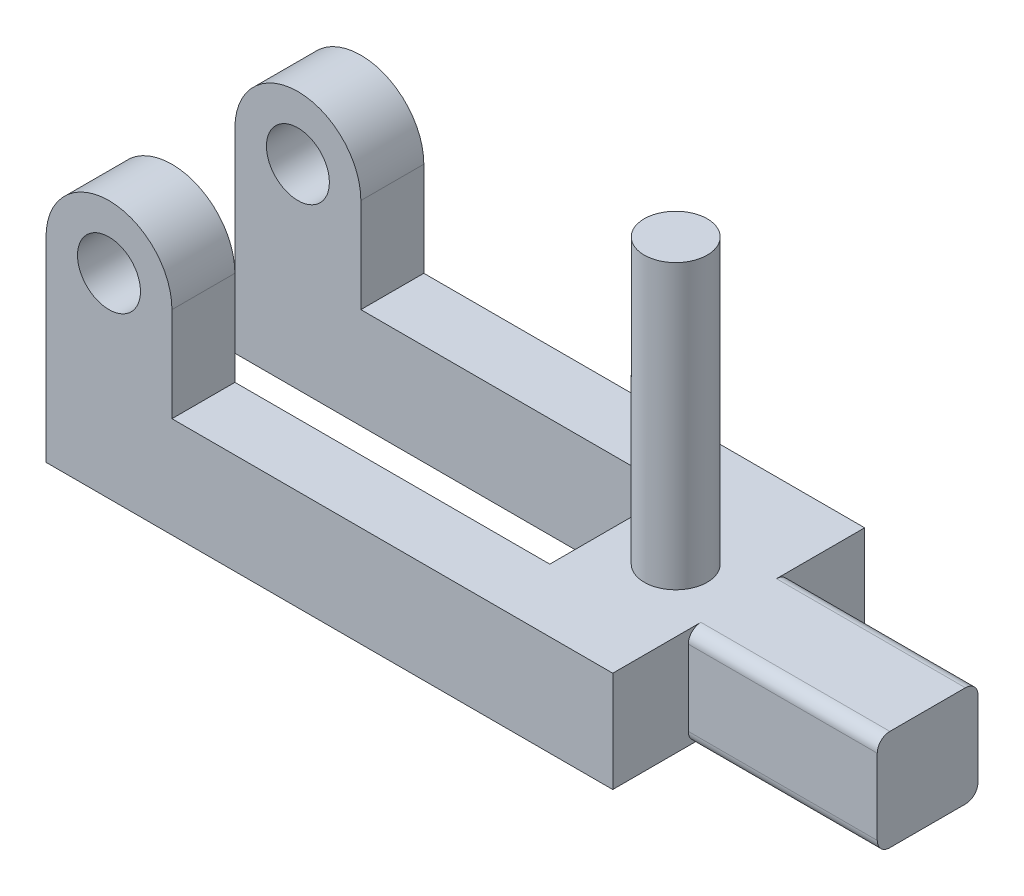
ISO-10303-21;
HEADER;
FILE_DESCRIPTION(('STEP AP214'),'2;1');
FILE_NAME('part.step','',(''),(''),'','','');
FILE_SCHEMA(('AUTOMOTIVE_DESIGN { 1 0 10303 214 1 1 1 1 }'));
ENDSEC;
DATA;
#1=APPLICATION_CONTEXT('core data for automotive mechanical design processes');
#2=APPLICATION_PROTOCOL_DEFINITION('international standard','automotive_design',2000,#1);
#3=PRODUCT_CONTEXT('',#1,'mechanical');
#4=PRODUCT('Part','Part','',(#3));
#5=PRODUCT_RELATED_PRODUCT_CATEGORY('part','',(#4));
#6=PRODUCT_DEFINITION_FORMATION('','',#4);
#7=PRODUCT_DEFINITION_CONTEXT('part definition',#1,'design');
#8=PRODUCT_DEFINITION('design','',#6,#7);
#9=PRODUCT_DEFINITION_SHAPE('','',#8);
#10=(LENGTH_UNIT() NAMED_UNIT(*) SI_UNIT(.MILLI.,.METRE.));
#11=(NAMED_UNIT(*) PLANE_ANGLE_UNIT() SI_UNIT($,.RADIAN.));
#12=(NAMED_UNIT(*) SI_UNIT($,.STERADIAN.) SOLID_ANGLE_UNIT());
#13=UNCERTAINTY_MEASURE_WITH_UNIT(LENGTH_MEASURE(1.E-05),#10,'distance_accuracy_value','');
#14=(GEOMETRIC_REPRESENTATION_CONTEXT(3) GLOBAL_UNCERTAINTY_ASSIGNED_CONTEXT((#13)) GLOBAL_UNIT_ASSIGNED_CONTEXT((#10,
#11,#12)) REPRESENTATION_CONTEXT('',''));
#15=CARTESIAN_POINT('',(0.,0.,0.));
#16=DIRECTION('',(0.,0.,1.));
#17=DIRECTION('',(1.,0.,0.));
#18=AXIS2_PLACEMENT_3D('',#15,#16,#17);
#19=CARTESIAN_POINT('',(0.,16.,0.));
#20=DIRECTION('',(1.,0.,0.));
#21=DIRECTION('',(0.,0.,-1.));
#22=AXIS2_PLACEMENT_3D('',#19,#20,#21);
#23=PLANE('',#22);
#24=DIRECTION('',(0.,0.,1.));
#25=VECTOR('',#24,1.);
#26=CARTESIAN_POINT('',(0.,0.,0.));
#27=LINE('',#26,#25);
#28=CARTESIAN_POINT('',(0.,0.,-10.));
#29=VERTEX_POINT('',#28);
#30=CARTESIAN_POINT('',(0.,0.,0.));
#31=VERTEX_POINT('',#30);
#32=EDGE_CURVE('E226',#29,#31,#27,.T.);
#33=ORIENTED_EDGE('',*,*,#32,.T.);
#34=DIRECTION('',(0.,-1.,0.));
#35=VECTOR('',#34,1.);
#36=CARTESIAN_POINT('',(0.,16.,0.));
#37=LINE('',#36,#35);
#38=CARTESIAN_POINT('',(0.,31.,0.));
#39=VERTEX_POINT('',#38);
#40=EDGE_CURVE('E297',#39,#31,#37,.T.);
#41=ORIENTED_EDGE('',*,*,#40,.F.);
#42=DIRECTION('',(0.,0.,1.));
#43=VECTOR('',#42,1.);
#44=CARTESIAN_POINT('',(0.,31.,-10.));
#45=LINE('',#44,#43);
#46=CARTESIAN_POINT('',(0.,31.,-10.));
#47=VERTEX_POINT('',#46);
#48=EDGE_CURVE('E223',#47,#39,#45,.T.);
#49=ORIENTED_EDGE('',*,*,#48,.F.);
#50=DIRECTION('',(0.,-1.,0.));
#51=VECTOR('',#50,1.);
#52=CARTESIAN_POINT('',(0.,16.,-10.));
#53=LINE('',#52,#51);
#54=EDGE_CURVE('E246',#47,#29,#53,.T.);
#55=ORIENTED_EDGE('',*,*,#54,.T.);
#56=EDGE_LOOP('',(#33,#41,#49,#55));
#57=FACE_BOUND('',#56,.T.);
#58=ADVANCED_FACE('F33',(#57),#23,.F.);
#59=CARTESIAN_POINT('',(0.,16.,0.));
#60=DIRECTION('',(0.,0.,-1.));
#61=DIRECTION('',(-1.,0.,0.));
#62=AXIS2_PLACEMENT_3D('',#59,#60,#61);
#63=PLANE('',#62);
#64=DIRECTION('',(1.,0.,0.));
#65=VECTOR('',#64,1.);
#66=CARTESIAN_POINT('',(0.,0.,0.));
#67=LINE('',#66,#65);
#68=CARTESIAN_POINT('',(90.,0.,0.));
#69=VERTEX_POINT('',#68);
#70=EDGE_CURVE('E249',#31,#69,#67,.T.);
#71=ORIENTED_EDGE('',*,*,#70,.T.);
#72=DIRECTION('',(0.,-1.,0.));
#73=VECTOR('',#72,1.);
#74=CARTESIAN_POINT('',(90.,16.,0.));
#75=LINE('',#74,#73);
#76=CARTESIAN_POINT('',(90.,16.,0.));
#77=VERTEX_POINT('',#76);
#78=EDGE_CURVE('E294',#77,#69,#75,.T.);
#79=ORIENTED_EDGE('',*,*,#78,.F.);
#80=DIRECTION('',(1.,0.,0.));
#81=VECTOR('',#80,1.);
#82=CARTESIAN_POINT('',(0.,16.,0.));
#83=LINE('',#82,#81);
#84=CARTESIAN_POINT('',(20.,16.,0.));
#85=VERTEX_POINT('',#84);
#86=EDGE_CURVE('E230',#85,#77,#83,.T.);
#87=ORIENTED_EDGE('',*,*,#86,.F.);
#88=DIRECTION('',(0.,1.,0.));
#89=VECTOR('',#88,1.);
#90=CARTESIAN_POINT('',(20.,16.,0.));
#91=LINE('',#90,#89);
#92=CARTESIAN_POINT('',(20.,31.,0.));
#93=VERTEX_POINT('',#92);
#94=EDGE_CURVE('E208',#85,#93,#91,.T.);
#95=ORIENTED_EDGE('',*,*,#94,.T.);
#96=CARTESIAN_POINT('',(9.99999999999999,31.,0.));
#97=DIRECTION('',(0.,0.,1.));
#98=DIRECTION('',(1.,0.,0.));
#99=AXIS2_PLACEMENT_3D('',#96,#97,#98);
#100=CIRCLE('',#99,9.99999999999999);
#101=EDGE_CURVE('E215',#93,#39,#100,.T.);
#102=ORIENTED_EDGE('',*,*,#101,.T.);
#103=ORIENTED_EDGE('',*,*,#40,.T.);
#104=EDGE_LOOP('',(#71,#79,#87,#95,#102,#103));
#105=FACE_BOUND('',#104,.T.);
#106=CARTESIAN_POINT('',(9.99999999999999,31.,0.));
#107=DIRECTION('',(0.,0.,1.));
#108=DIRECTION('',(1.,0.,0.));
#109=AXIS2_PLACEMENT_3D('',#106,#107,#108);
#110=CIRCLE('',#109,5.);
#111=CARTESIAN_POINT('',(15.,31.,0.));
#112=VERTEX_POINT('',#111);
#113=EDGE_CURVE('E203',#112,#112,#110,.T.);
#114=ORIENTED_EDGE('',*,*,#113,.F.);
#115=EDGE_LOOP('',(#114));
#116=FACE_BOUND('',#115,.T.);
#117=ADVANCED_FACE('F386',(#105,#116),#63,.F.);
#118=CARTESIAN_POINT('',(90.,16.,0.));
#119=DIRECTION('',(-1.,0.,0.));
#120=DIRECTION('',(0.,0.,1.));
#121=AXIS2_PLACEMENT_3D('',#118,#119,#120);
#122=PLANE('',#121);
#123=DIRECTION('',(0.,0.,-1.));
#124=VECTOR('',#123,1.);
#125=CARTESIAN_POINT('',(90.,0.,0.));
#126=LINE('',#125,#124);
#127=CARTESIAN_POINT('',(90.,0.,-14.));
#128=VERTEX_POINT('',#127);
#129=EDGE_CURVE('E251',#69,#128,#126,.T.);
#130=ORIENTED_EDGE('',*,*,#129,.T.);
#131=CARTESIAN_POINT('',(90.,2.,-14.));
#132=DIRECTION('',(-1.,0.,0.));
#133=DIRECTION('',(0.,0.,1.));
#134=AXIS2_PLACEMENT_3D('',#131,#132,#133);
#135=CIRCLE('',#134,2.);
#136=CARTESIAN_POINT('',(90.,2.,-12.));
#137=VERTEX_POINT('',#136);
#138=EDGE_CURVE('E332',#128,#137,#135,.T.);
#139=ORIENTED_EDGE('',*,*,#138,.T.);
#140=DIRECTION('',(0.,-1.,0.));
#141=VECTOR('',#140,1.);
#142=CARTESIAN_POINT('',(90.,16.,-12.));
#143=LINE('',#142,#141);
#144=CARTESIAN_POINT('',(90.,14.,-12.));
#145=VERTEX_POINT('',#144);
#146=EDGE_CURVE('E291',#145,#137,#143,.T.);
#147=ORIENTED_EDGE('',*,*,#146,.F.);
#148=CARTESIAN_POINT('',(90.,14.,-14.));
#149=DIRECTION('',(-1.,0.,0.));
#150=DIRECTION('',(0.,0.,1.));
#151=AXIS2_PLACEMENT_3D('',#148,#149,#150);
#152=CIRCLE('',#151,2.);
#153=CARTESIAN_POINT('',(90.,16.,-14.));
#154=VERTEX_POINT('',#153);
#155=EDGE_CURVE('E41',#145,#154,#152,.T.);
#156=ORIENTED_EDGE('',*,*,#155,.T.);
#157=DIRECTION('',(0.,0.,-1.));
#158=VECTOR('',#157,1.);
#159=CARTESIAN_POINT('',(90.,16.,0.));
#160=LINE('',#159,#158);
#161=EDGE_CURVE('E232',#77,#154,#160,.T.);
#162=ORIENTED_EDGE('',*,*,#161,.F.);
#163=ORIENTED_EDGE('',*,*,#78,.T.);
#164=EDGE_LOOP('',(#130,#139,#147,#156,#162,#163));
#165=FACE_BOUND('',#164,.T.);
#166=ADVANCED_FACE('F341',(#165),#122,.F.);
#167=CARTESIAN_POINT('',(90.,16.,-12.));
#168=DIRECTION('',(0.,0.,-1.));
#169=DIRECTION('',(-1.,0.,0.));
#170=AXIS2_PLACEMENT_3D('',#167,#168,#169);
#171=PLANE('',#170);
#172=ORIENTED_EDGE('',*,*,#146,.T.);
#173=DIRECTION('',(1.,0.,0.));
#174=VECTOR('',#173,1.);
#175=CARTESIAN_POINT('',(120.,2.,-12.));
#176=LINE('',#175,#174);
#177=CARTESIAN_POINT('',(120.,2.,-12.));
#178=VERTEX_POINT('',#177);
#179=EDGE_CURVE('E320',#137,#178,#176,.T.);
#180=ORIENTED_EDGE('',*,*,#179,.T.);
#181=DIRECTION('',(0.,-1.,0.));
#182=VECTOR('',#181,1.);
#183=CARTESIAN_POINT('',(120.,16.,-12.));
#184=LINE('',#183,#182);
#185=CARTESIAN_POINT('',(120.,14.,-12.));
#186=VERTEX_POINT('',#185);
#187=EDGE_CURVE('E288',#186,#178,#184,.T.);
#188=ORIENTED_EDGE('',*,*,#187,.F.);
#189=DIRECTION('',(1.,0.,0.));
#190=VECTOR('',#189,1.);
#191=CARTESIAN_POINT('',(90.,14.,-12.));
#192=LINE('',#191,#190);
#193=EDGE_CURVE('E318',#186,#145,#192,.F.);
#194=ORIENTED_EDGE('',*,*,#193,.T.);
#195=EDGE_LOOP('',(#172,#180,#188,#194));
#196=FACE_BOUND('',#195,.T.);
#197=ADVANCED_FACE('F397',(#196),#171,.F.);
#198=CARTESIAN_POINT('',(120.,16.,-12.));
#199=DIRECTION('',(-1.,0.,0.));
#200=DIRECTION('',(0.,0.,1.));
#201=AXIS2_PLACEMENT_3D('',#198,#199,#200);
#202=PLANE('',#201);
#203=DIRECTION('',(0.,0.,-1.));
#204=VECTOR('',#203,1.);
#205=CARTESIAN_POINT('',(120.,0.,-12.));
#206=LINE('',#205,#204);
#207=CARTESIAN_POINT('',(120.,0.,-14.));
#208=VERTEX_POINT('',#207);
#209=CARTESIAN_POINT('',(120.,0.,-26.));
#210=VERTEX_POINT('',#209);
#211=EDGE_CURVE('E253',#208,#210,#206,.T.);
#212=ORIENTED_EDGE('',*,*,#211,.T.);
#213=CARTESIAN_POINT('',(120.,2.,-26.));
#214=DIRECTION('',(-1.,0.,0.));
#215=DIRECTION('',(0.,0.,1.));
#216=AXIS2_PLACEMENT_3D('',#213,#214,#215);
#217=CIRCLE('',#216,2.);
#218=CARTESIAN_POINT('',(120.,2.,-28.));
#219=VERTEX_POINT('',#218);
#220=EDGE_CURVE('E316',#210,#219,#217,.F.);
#221=ORIENTED_EDGE('',*,*,#220,.T.);
#222=DIRECTION('',(0.,-1.,0.));
#223=VECTOR('',#222,1.);
#224=CARTESIAN_POINT('',(120.,16.,-28.));
#225=LINE('',#224,#223);
#226=CARTESIAN_POINT('',(120.,14.,-28.));
#227=VERTEX_POINT('',#226);
#228=EDGE_CURVE('E285',#227,#219,#225,.T.);
#229=ORIENTED_EDGE('',*,*,#228,.F.);
#230=CARTESIAN_POINT('',(120.,14.,-26.));
#231=DIRECTION('',(-1.,0.,0.));
#232=DIRECTION('',(0.,0.,1.));
#233=AXIS2_PLACEMENT_3D('',#230,#231,#232);
#234=CIRCLE('',#233,2.);
#235=CARTESIAN_POINT('',(120.,16.,-26.));
#236=VERTEX_POINT('',#235);
#237=EDGE_CURVE('E312',#227,#236,#234,.F.);
#238=ORIENTED_EDGE('',*,*,#237,.T.);
#239=DIRECTION('',(0.,0.,-1.));
#240=VECTOR('',#239,1.);
#241=CARTESIAN_POINT('',(120.,16.,-12.));
#242=LINE('',#241,#240);
#243=CARTESIAN_POINT('',(120.,16.,-14.));
#244=VERTEX_POINT('',#243);
#245=EDGE_CURVE('E235',#244,#236,#242,.T.);
#246=ORIENTED_EDGE('',*,*,#245,.F.);
#247=CARTESIAN_POINT('',(120.,14.,-14.));
#248=DIRECTION('',(-1.,0.,0.));
#249=DIRECTION('',(0.,0.,1.));
#250=AXIS2_PLACEMENT_3D('',#247,#248,#249);
#251=CIRCLE('',#250,2.);
#252=EDGE_CURVE('E310',#244,#186,#251,.F.);
#253=ORIENTED_EDGE('',*,*,#252,.T.);
#254=ORIENTED_EDGE('',*,*,#187,.T.);
#255=CARTESIAN_POINT('',(120.,2.,-14.));
#256=DIRECTION('',(-1.,0.,0.));
#257=DIRECTION('',(0.,0.,1.));
#258=AXIS2_PLACEMENT_3D('',#255,#256,#257);
#259=CIRCLE('',#258,2.);
#260=EDGE_CURVE('E314',#178,#208,#259,.F.);
#261=ORIENTED_EDGE('',*,*,#260,.T.);
#262=EDGE_LOOP('',(#212,#221,#229,#238,#246,#253,#254,#261));
#263=FACE_BOUND('',#262,.T.);
#264=ADVANCED_FACE('F348',(#263),#202,.F.);
#265=CARTESIAN_POINT('',(90.,16.,-28.));
#266=DIRECTION('',(0.,0.,1.));
#267=DIRECTION('',(1.,0.,0.));
#268=AXIS2_PLACEMENT_3D('',#265,#266,#267);
#269=PLANE('',#268);
#270=ORIENTED_EDGE('',*,*,#228,.T.);
#271=DIRECTION('',(-1.,0.,0.));
#272=VECTOR('',#271,1.);
#273=CARTESIAN_POINT('',(90.,2.,-28.));
#274=LINE('',#273,#272);
#275=CARTESIAN_POINT('',(90.,2.,-28.));
#276=VERTEX_POINT('',#275);
#277=EDGE_CURVE('E302',#219,#276,#274,.T.);
#278=ORIENTED_EDGE('',*,*,#277,.T.);
#279=DIRECTION('',(0.,-1.,0.));
#280=VECTOR('',#279,1.);
#281=CARTESIAN_POINT('',(90.,16.,-28.));
#282=LINE('',#281,#280);
#283=CARTESIAN_POINT('',(90.,14.,-28.));
#284=VERTEX_POINT('',#283);
#285=EDGE_CURVE('E282',#284,#276,#282,.T.);
#286=ORIENTED_EDGE('',*,*,#285,.F.);
#287=DIRECTION('',(-1.,0.,0.));
#288=VECTOR('',#287,1.);
#289=CARTESIAN_POINT('',(90.,14.,-28.));
#290=LINE('',#289,#288);
#291=EDGE_CURVE('E300',#284,#227,#290,.F.);
#292=ORIENTED_EDGE('',*,*,#291,.T.);
#293=EDGE_LOOP('',(#270,#278,#286,#292));
#294=FACE_BOUND('',#293,.T.);
#295=ADVANCED_FACE('F405',(#294),#269,.F.);
#296=CARTESIAN_POINT('',(90.,16.,-28.));
#297=DIRECTION('',(-1.,0.,0.));
#298=DIRECTION('',(0.,0.,1.));
#299=AXIS2_PLACEMENT_3D('',#296,#297,#298);
#300=PLANE('',#299);
#301=DIRECTION('',(0.,0.,-1.));
#302=VECTOR('',#301,1.);
#303=CARTESIAN_POINT('',(90.,0.,-28.));
#304=LINE('',#303,#302);
#305=CARTESIAN_POINT('',(90.,0.,-26.));
#306=VERTEX_POINT('',#305);
#307=CARTESIAN_POINT('',(90.,0.,-40.));
#308=VERTEX_POINT('',#307);
#309=EDGE_CURVE('E256',#306,#308,#304,.T.);
#310=ORIENTED_EDGE('',*,*,#309,.T.);
#311=DIRECTION('',(0.,-1.,0.));
#312=VECTOR('',#311,1.);
#313=CARTESIAN_POINT('',(90.,16.,-40.));
#314=LINE('',#313,#312);
#315=CARTESIAN_POINT('',(90.,16.,-40.));
#316=VERTEX_POINT('',#315);
#317=EDGE_CURVE('E279',#316,#308,#314,.T.);
#318=ORIENTED_EDGE('',*,*,#317,.F.);
#319=DIRECTION('',(0.,0.,-1.));
#320=VECTOR('',#319,1.);
#321=CARTESIAN_POINT('',(90.,16.,-28.));
#322=LINE('',#321,#320);
#323=CARTESIAN_POINT('',(90.,16.,-26.));
#324=VERTEX_POINT('',#323);
#325=EDGE_CURVE('E238',#324,#316,#322,.T.);
#326=ORIENTED_EDGE('',*,*,#325,.F.);
#327=CARTESIAN_POINT('',(90.,14.,-26.));
#328=DIRECTION('',(-1.,0.,0.));
#329=DIRECTION('',(0.,0.,1.));
#330=AXIS2_PLACEMENT_3D('',#327,#328,#329);
#331=CIRCLE('',#330,2.);
#332=EDGE_CURVE('E334',#324,#284,#331,.T.);
#333=ORIENTED_EDGE('',*,*,#332,.T.);
#334=ORIENTED_EDGE('',*,*,#285,.T.);
#335=CARTESIAN_POINT('',(90.,2.,-26.));
#336=DIRECTION('',(-1.,0.,0.));
#337=DIRECTION('',(0.,0.,1.));
#338=AXIS2_PLACEMENT_3D('',#335,#336,#337);
#339=CIRCLE('',#338,2.);
#340=EDGE_CURVE('E329',#276,#306,#339,.T.);
#341=ORIENTED_EDGE('',*,*,#340,.T.);
#342=EDGE_LOOP('',(#310,#318,#326,#333,#334,#341));
#343=FACE_BOUND('',#342,.T.);
#344=ADVANCED_FACE('F358',(#343),#300,.F.);
#345=CARTESIAN_POINT('',(0.,16.,-40.));
#346=DIRECTION('',(0.,0.,1.));
#347=DIRECTION('',(1.,0.,0.));
#348=AXIS2_PLACEMENT_3D('',#345,#346,#347);
#349=PLANE('',#348);
#350=DIRECTION('',(-1.,0.,0.));
#351=VECTOR('',#350,1.);
#352=CARTESIAN_POINT('',(0.,0.,-40.));
#353=LINE('',#352,#351);
#354=CARTESIAN_POINT('',(0.,0.,-40.));
#355=VERTEX_POINT('',#354);
#356=EDGE_CURVE('E258',#308,#355,#353,.T.);
#357=ORIENTED_EDGE('',*,*,#356,.T.);
#358=DIRECTION('',(0.,-1.,0.));
#359=VECTOR('',#358,1.);
#360=CARTESIAN_POINT('',(0.,16.,-40.));
#361=LINE('',#360,#359);
#362=CARTESIAN_POINT('',(0.,31.,-40.));
#363=VERTEX_POINT('',#362);
#364=EDGE_CURVE('E193',#363,#355,#361,.T.);
#365=ORIENTED_EDGE('',*,*,#364,.F.);
#366=CARTESIAN_POINT('',(9.99999999999999,31.,-40.));
#367=DIRECTION('',(0.,0.,1.));
#368=DIRECTION('',(1.,0.,0.));
#369=AXIS2_PLACEMENT_3D('',#366,#367,#368);
#370=CIRCLE('',#369,9.99999999999999);
#371=CARTESIAN_POINT('',(20.,31.,-40.));
#372=VERTEX_POINT('',#371);
#373=EDGE_CURVE('E176',#372,#363,#370,.T.);
#374=ORIENTED_EDGE('',*,*,#373,.F.);
#375=DIRECTION('',(0.,1.,0.));
#376=VECTOR('',#375,1.);
#377=CARTESIAN_POINT('',(20.,16.,-40.));
#378=LINE('',#377,#376);
#379=CARTESIAN_POINT('',(20.,16.,-40.));
#380=VERTEX_POINT('',#379);
#381=EDGE_CURVE('E186',#380,#372,#378,.T.);
#382=ORIENTED_EDGE('',*,*,#381,.F.);
#383=DIRECTION('',(-1.,0.,0.));
#384=VECTOR('',#383,1.);
#385=CARTESIAN_POINT('',(0.,16.,-40.));
#386=LINE('',#385,#384);
#387=EDGE_CURVE('E48',#316,#380,#386,.T.);
#388=ORIENTED_EDGE('',*,*,#387,.F.);
#389=ORIENTED_EDGE('',*,*,#317,.T.);
#390=EDGE_LOOP('',(#357,#365,#374,#382,#388,#389));
#391=FACE_BOUND('',#390,.T.);
#392=CARTESIAN_POINT('',(9.99999999999999,31.,-40.));
#393=DIRECTION('',(0.,0.,1.));
#394=DIRECTION('',(1.,0.,0.));
#395=AXIS2_PLACEMENT_3D('',#392,#393,#394);
#396=CIRCLE('',#395,5.);
#397=CARTESIAN_POINT('',(15.,31.,-40.));
#398=VERTEX_POINT('',#397);
#399=EDGE_CURVE('E201',#398,#398,#396,.T.);
#400=ORIENTED_EDGE('',*,*,#399,.T.);
#401=EDGE_LOOP('',(#400));
#402=FACE_BOUND('',#401,.T.);
#403=ADVANCED_FACE('F190',(#391,#402),#349,.F.);
#404=CARTESIAN_POINT('',(0.,16.,-30.));
#405=DIRECTION('',(1.,0.,0.));
#406=DIRECTION('',(0.,0.,-1.));
#407=AXIS2_PLACEMENT_3D('',#404,#405,#406);
#408=PLANE('',#407);
#409=DIRECTION('',(0.,0.,1.));
#410=VECTOR('',#409,1.);
#411=CARTESIAN_POINT('',(0.,0.,-30.));
#412=LINE('',#411,#410);
#413=CARTESIAN_POINT('',(0.,0.,-30.));
#414=VERTEX_POINT('',#413);
#415=EDGE_CURVE('E260',#355,#414,#412,.T.);
#416=ORIENTED_EDGE('',*,*,#415,.T.);
#417=DIRECTION('',(0.,-1.,0.));
#418=VECTOR('',#417,1.);
#419=CARTESIAN_POINT('',(0.,16.,-30.));
#420=LINE('',#419,#418);
#421=CARTESIAN_POINT('',(0.,31.,-30.));
#422=VERTEX_POINT('',#421);
#423=EDGE_CURVE('E275',#422,#414,#420,.T.);
#424=ORIENTED_EDGE('',*,*,#423,.F.);
#425=DIRECTION('',(0.,0.,1.));
#426=VECTOR('',#425,1.);
#427=CARTESIAN_POINT('',(0.,31.,-40.));
#428=LINE('',#427,#426);
#429=EDGE_CURVE('E182',#363,#422,#428,.T.);
#430=ORIENTED_EDGE('',*,*,#429,.F.);
#431=ORIENTED_EDGE('',*,*,#364,.T.);
#432=EDGE_LOOP('',(#416,#424,#430,#431));
#433=FACE_BOUND('',#432,.T.);
#434=ADVANCED_FACE('F366',(#433),#408,.F.);
#435=CARTESIAN_POINT('',(0.,16.,-30.));
#436=DIRECTION('',(0.,0.,-1.));
#437=DIRECTION('',(-1.,0.,0.));
#438=AXIS2_PLACEMENT_3D('',#435,#436,#437);
#439=PLANE('',#438);
#440=DIRECTION('',(1.,0.,0.));
#441=VECTOR('',#440,1.);
#442=CARTESIAN_POINT('',(0.,0.,-30.));
#443=LINE('',#442,#441);
#444=CARTESIAN_POINT('',(70.,0.,-30.));
#445=VERTEX_POINT('',#444);
#446=EDGE_CURVE('E262',#414,#445,#443,.T.);
#447=ORIENTED_EDGE('',*,*,#446,.T.);
#448=DIRECTION('',(0.,-1.,0.));
#449=VECTOR('',#448,1.);
#450=CARTESIAN_POINT('',(70.,16.,-30.));
#451=LINE('',#450,#449);
#452=CARTESIAN_POINT('',(70.,16.,-30.));
#453=VERTEX_POINT('',#452);
#454=EDGE_CURVE('E272',#453,#445,#451,.T.);
#455=ORIENTED_EDGE('',*,*,#454,.F.);
#456=DIRECTION('',(1.,0.,0.));
#457=VECTOR('',#456,1.);
#458=CARTESIAN_POINT('',(0.,16.,-30.));
#459=LINE('',#458,#457);
#460=CARTESIAN_POINT('',(20.,16.,-30.));
#461=VERTEX_POINT('',#460);
#462=EDGE_CURVE('E241',#461,#453,#459,.T.);
#463=ORIENTED_EDGE('',*,*,#462,.F.);
#464=DIRECTION('',(0.,1.,0.));
#465=VECTOR('',#464,1.);
#466=CARTESIAN_POINT('',(20.,16.,-30.));
#467=LINE('',#466,#465);
#468=CARTESIAN_POINT('',(20.,31.,-30.));
#469=VERTEX_POINT('',#468);
#470=EDGE_CURVE('E199',#461,#469,#467,.T.);
#471=ORIENTED_EDGE('',*,*,#470,.T.);
#472=CARTESIAN_POINT('',(9.99999999999999,31.,-30.));
#473=DIRECTION('',(0.,0.,1.));
#474=DIRECTION('',(1.,0.,0.));
#475=AXIS2_PLACEMENT_3D('',#472,#473,#474);
#476=CIRCLE('',#475,9.99999999999999);
#477=EDGE_CURVE('E178',#469,#422,#476,.T.);
#478=ORIENTED_EDGE('',*,*,#477,.T.);
#479=ORIENTED_EDGE('',*,*,#423,.T.);
#480=EDGE_LOOP('',(#447,#455,#463,#471,#478,#479));
#481=FACE_BOUND('',#480,.T.);
#482=CARTESIAN_POINT('',(9.99999999999999,31.,-30.));
#483=DIRECTION('',(0.,0.,1.));
#484=DIRECTION('',(1.,0.,0.));
#485=AXIS2_PLACEMENT_3D('',#482,#483,#484);
#486=CIRCLE('',#485,5.);
#487=CARTESIAN_POINT('',(15.,31.,-30.));
#488=VERTEX_POINT('',#487);
#489=EDGE_CURVE('E638',#488,#488,#486,.T.);
#490=ORIENTED_EDGE('',*,*,#489,.F.);
#491=EDGE_LOOP('',(#490));
#492=FACE_BOUND('',#491,.T.);
#493=ADVANCED_FACE('F368',(#481,#492),#439,.F.);
#494=CARTESIAN_POINT('',(70.,16.,-10.));
#495=DIRECTION('',(1.,0.,0.));
#496=DIRECTION('',(0.,0.,-1.));
#497=AXIS2_PLACEMENT_3D('',#494,#495,#496);
#498=PLANE('',#497);
#499=DIRECTION('',(0.,0.,1.));
#500=VECTOR('',#499,1.);
#501=CARTESIAN_POINT('',(70.,0.,-10.));
#502=LINE('',#501,#500);
#503=CARTESIAN_POINT('',(70.,0.,-10.));
#504=VERTEX_POINT('',#503);
#505=EDGE_CURVE('E264',#445,#504,#502,.T.);
#506=ORIENTED_EDGE('',*,*,#505,.T.);
#507=DIRECTION('',(0.,-1.,0.));
#508=VECTOR('',#507,1.);
#509=CARTESIAN_POINT('',(70.,16.,-10.));
#510=LINE('',#509,#508);
#511=CARTESIAN_POINT('',(70.,16.,-10.));
#512=VERTEX_POINT('',#511);
#513=EDGE_CURVE('E269',#512,#504,#510,.T.);
#514=ORIENTED_EDGE('',*,*,#513,.F.);
#515=DIRECTION('',(0.,0.,1.));
#516=VECTOR('',#515,1.);
#517=CARTESIAN_POINT('',(70.,16.,-10.));
#518=LINE('',#517,#516);
#519=EDGE_CURVE('E243',#453,#512,#518,.T.);
#520=ORIENTED_EDGE('',*,*,#519,.F.);
#521=ORIENTED_EDGE('',*,*,#454,.T.);
#522=EDGE_LOOP('',(#506,#514,#520,#521));
#523=FACE_BOUND('',#522,.T.);
#524=ADVANCED_FACE('F374',(#523),#498,.F.);
#525=CARTESIAN_POINT('',(0.,16.,-10.));
#526=DIRECTION('',(0.,0.,1.));
#527=DIRECTION('',(1.,0.,0.));
#528=AXIS2_PLACEMENT_3D('',#525,#526,#527);
#529=PLANE('',#528);
#530=DIRECTION('',(-1.,0.,0.));
#531=VECTOR('',#530,1.);
#532=CARTESIAN_POINT('',(0.,0.,-10.));
#533=LINE('',#532,#531);
#534=EDGE_CURVE('E233',#504,#29,#533,.T.);
#535=ORIENTED_EDGE('',*,*,#534,.T.);
#536=ORIENTED_EDGE('',*,*,#54,.F.);
#537=CARTESIAN_POINT('',(9.99999999999999,31.,-10.));
#538=DIRECTION('',(0.,0.,1.));
#539=DIRECTION('',(1.,0.,0.));
#540=AXIS2_PLACEMENT_3D('',#537,#538,#539);
#541=CIRCLE('',#540,9.99999999999999);
#542=CARTESIAN_POINT('',(20.,31.,-10.));
#543=VERTEX_POINT('',#542);
#544=EDGE_CURVE('E214',#543,#47,#541,.T.);
#545=ORIENTED_EDGE('',*,*,#544,.F.);
#546=DIRECTION('',(0.,1.,0.));
#547=VECTOR('',#546,1.);
#548=CARTESIAN_POINT('',(20.,16.,-10.));
#549=LINE('',#548,#547);
#550=CARTESIAN_POINT('',(20.,16.,-10.));
#551=VERTEX_POINT('',#550);
#552=EDGE_CURVE('E211',#551,#543,#549,.T.);
#553=ORIENTED_EDGE('',*,*,#552,.F.);
#554=DIRECTION('',(-1.,0.,0.));
#555=VECTOR('',#554,1.);
#556=CARTESIAN_POINT('',(0.,16.,-10.));
#557=LINE('',#556,#555);
#558=EDGE_CURVE('E55',#512,#551,#557,.T.);
#559=ORIENTED_EDGE('',*,*,#558,.F.);
#560=ORIENTED_EDGE('',*,*,#513,.T.);
#561=EDGE_LOOP('',(#535,#536,#545,#553,#559,#560));
#562=FACE_BOUND('',#561,.T.);
#563=CARTESIAN_POINT('',(9.99999999999999,31.,-10.));
#564=DIRECTION('',(0.,0.,1.));
#565=DIRECTION('',(1.,0.,0.));
#566=AXIS2_PLACEMENT_3D('',#563,#564,#565);
#567=CIRCLE('',#566,5.);
#568=CARTESIAN_POINT('',(15.,31.,-10.));
#569=VERTEX_POINT('',#568);
#570=EDGE_CURVE('E205',#569,#569,#567,.T.);
#571=ORIENTED_EDGE('',*,*,#570,.T.);
#572=EDGE_LOOP('',(#571));
#573=FACE_BOUND('',#572,.T.);
#574=ADVANCED_FACE('F378',(#562,#573),#529,.F.);
#575=CARTESIAN_POINT('',(0.,16.,0.));
#576=DIRECTION('',(0.,-1.,0.));
#577=DIRECTION('',(0.,0.,-1.));
#578=AXIS2_PLACEMENT_3D('',#575,#576,#577);
#579=PLANE('',#578);
#580=CARTESIAN_POINT('',(80.,16.,-20.));
#581=DIRECTION('',(0.,-1.,0.));
#582=DIRECTION('',(0.,0.,-1.));
#583=AXIS2_PLACEMENT_3D('',#580,#581,#582);
#584=CIRCLE('',#583,5.);
#585=CARTESIAN_POINT('',(80.,16.,-25.));
#586=VERTEX_POINT('',#585);
#587=EDGE_CURVE('E11',#586,#586,#584,.F.);
#588=ORIENTED_EDGE('',*,*,#587,.F.);
#589=EDGE_LOOP('',(#588));
#590=FACE_BOUND('',#589,.T.);
#591=ORIENTED_EDGE('',*,*,#387,.T.);
#592=DIRECTION('',(0.,0.,1.));
#593=VECTOR('',#592,1.);
#594=CARTESIAN_POINT('',(20.,16.,-40.));
#595=LINE('',#594,#593);
#596=EDGE_CURVE('E183',#380,#461,#595,.T.);
#597=ORIENTED_EDGE('',*,*,#596,.T.);
#598=ORIENTED_EDGE('',*,*,#462,.T.);
#599=ORIENTED_EDGE('',*,*,#519,.T.);
#600=ORIENTED_EDGE('',*,*,#558,.T.);
#601=DIRECTION('',(0.,0.,1.));
#602=VECTOR('',#601,1.);
#603=CARTESIAN_POINT('',(20.,16.,-10.));
#604=LINE('',#603,#602);
#605=EDGE_CURVE('E218',#551,#85,#604,.T.);
#606=ORIENTED_EDGE('',*,*,#605,.T.);
#607=ORIENTED_EDGE('',*,*,#86,.T.);
#608=ORIENTED_EDGE('',*,*,#161,.T.);
#609=DIRECTION('',(1.,0.,0.));
#610=VECTOR('',#609,1.);
#611=CARTESIAN_POINT('',(0.,16.,-14.));
#612=LINE('',#611,#610);
#613=EDGE_CURVE('E323',#154,#244,#612,.T.);
#614=ORIENTED_EDGE('',*,*,#613,.T.);
#615=ORIENTED_EDGE('',*,*,#245,.T.);
#616=DIRECTION('',(-1.,0.,0.));
#617=VECTOR('',#616,1.);
#618=CARTESIAN_POINT('',(0.,16.,-26.));
#619=LINE('',#618,#617);
#620=EDGE_CURVE('E326',#236,#324,#619,.T.);
#621=ORIENTED_EDGE('',*,*,#620,.T.);
#622=ORIENTED_EDGE('',*,*,#325,.T.);
#623=EDGE_LOOP('',(#591,#597,#598,#599,#600,#606,#607,#608,#614,#615,#621,#622));
#624=FACE_BOUND('',#623,.T.);
#625=ADVANCED_FACE('F345',(#590,#624),#579,.F.);
#626=CARTESIAN_POINT('',(0.,0.,0.));
#627=DIRECTION('',(0.,-1.,0.));
#628=DIRECTION('',(0.,0.,-1.));
#629=AXIS2_PLACEMENT_3D('',#626,#627,#628);
#630=PLANE('',#629);
#631=ORIENTED_EDGE('',*,*,#309,.F.);
#632=DIRECTION('',(-1.,0.,0.));
#633=VECTOR('',#632,1.);
#634=CARTESIAN_POINT('',(120.,0.,-26.));
#635=LINE('',#634,#633);
#636=EDGE_CURVE('E308',#306,#210,#635,.F.);
#637=ORIENTED_EDGE('',*,*,#636,.T.);
#638=ORIENTED_EDGE('',*,*,#211,.F.);
#639=DIRECTION('',(1.,0.,0.));
#640=VECTOR('',#639,1.);
#641=CARTESIAN_POINT('',(90.,0.,-14.));
#642=LINE('',#641,#640);
#643=EDGE_CURVE('E305',#208,#128,#642,.F.);
#644=ORIENTED_EDGE('',*,*,#643,.T.);
#645=ORIENTED_EDGE('',*,*,#129,.F.);
#646=ORIENTED_EDGE('',*,*,#70,.F.);
#647=ORIENTED_EDGE('',*,*,#32,.F.);
#648=ORIENTED_EDGE('',*,*,#534,.F.);
#649=ORIENTED_EDGE('',*,*,#505,.F.);
#650=ORIENTED_EDGE('',*,*,#446,.F.);
#651=ORIENTED_EDGE('',*,*,#415,.F.);
#652=ORIENTED_EDGE('',*,*,#356,.F.);
#653=EDGE_LOOP('',(#631,#637,#638,#644,#645,#646,#647,#648,#649,#650,#651,#652));
#654=FACE_BOUND('',#653,.T.);
#655=ADVANCED_FACE('F362',(#654),#630,.T.);
#656=CARTESIAN_POINT('',(90.,2.,-26.));
#657=DIRECTION('',(1.,0.,0.));
#658=DIRECTION('',(0.,0.,-1.));
#659=AXIS2_PLACEMENT_3D('',#656,#657,#658);
#660=CYLINDRICAL_SURFACE('',#659,2.);
#661=ORIENTED_EDGE('',*,*,#220,.F.);
#662=ORIENTED_EDGE('',*,*,#636,.F.);
#663=ORIENTED_EDGE('',*,*,#340,.F.);
#664=ORIENTED_EDGE('',*,*,#277,.F.);
#665=EDGE_LOOP('',(#661,#662,#663,#664));
#666=FACE_BOUND('',#665,.T.);
#667=ADVANCED_FACE('F402',(#666),#660,.T.);
#668=CARTESIAN_POINT('',(90.,2.,-14.));
#669=DIRECTION('',(-1.,0.,0.));
#670=DIRECTION('',(0.,0.,1.));
#671=AXIS2_PLACEMENT_3D('',#668,#669,#670);
#672=CYLINDRICAL_SURFACE('',#671,2.);
#673=ORIENTED_EDGE('',*,*,#138,.F.);
#674=ORIENTED_EDGE('',*,*,#643,.F.);
#675=ORIENTED_EDGE('',*,*,#260,.F.);
#676=ORIENTED_EDGE('',*,*,#179,.F.);
#677=EDGE_LOOP('',(#673,#674,#675,#676));
#678=FACE_BOUND('',#677,.T.);
#679=ADVANCED_FACE('F395',(#678),#672,.T.);
#680=CARTESIAN_POINT('',(0.,14.,-26.));
#681=DIRECTION('',(-1.,0.,0.));
#682=DIRECTION('',(0.,0.,1.));
#683=AXIS2_PLACEMENT_3D('',#680,#681,#682);
#684=CYLINDRICAL_SURFACE('',#683,2.);
#685=ORIENTED_EDGE('',*,*,#237,.F.);
#686=ORIENTED_EDGE('',*,*,#291,.F.);
#687=ORIENTED_EDGE('',*,*,#332,.F.);
#688=ORIENTED_EDGE('',*,*,#620,.F.);
#689=EDGE_LOOP('',(#685,#686,#687,#688));
#690=FACE_BOUND('',#689,.T.);
#691=ADVANCED_FACE('F354',(#690),#684,.T.);
#692=CARTESIAN_POINT('',(0.,14.,-14.));
#693=DIRECTION('',(1.,0.,0.));
#694=DIRECTION('',(0.,0.,-1.));
#695=AXIS2_PLACEMENT_3D('',#692,#693,#694);
#696=CYLINDRICAL_SURFACE('',#695,2.);
#697=ORIENTED_EDGE('',*,*,#155,.F.);
#698=ORIENTED_EDGE('',*,*,#193,.F.);
#699=ORIENTED_EDGE('',*,*,#252,.F.);
#700=ORIENTED_EDGE('',*,*,#613,.F.);
#701=EDGE_LOOP('',(#697,#698,#699,#700));
#702=FACE_BOUND('',#701,.T.);
#703=ADVANCED_FACE('F35',(#702),#696,.T.);
#704=CARTESIAN_POINT('',(9.99999999999999,31.,-10.));
#705=DIRECTION('',(0.,0.,1.));
#706=DIRECTION('',(1.,0.,0.));
#707=AXIS2_PLACEMENT_3D('',#704,#705,#706);
#708=CYLINDRICAL_SURFACE('',#707,9.99999999999999);
#709=ORIENTED_EDGE('',*,*,#101,.F.);
#710=DIRECTION('',(0.,0.,1.));
#711=VECTOR('',#710,1.);
#712=CARTESIAN_POINT('',(20.,31.,-10.));
#713=LINE('',#712,#711);
#714=EDGE_CURVE('E227',#543,#93,#713,.T.);
#715=ORIENTED_EDGE('',*,*,#714,.F.);
#716=ORIENTED_EDGE('',*,*,#544,.T.);
#717=ORIENTED_EDGE('',*,*,#48,.T.);
#718=EDGE_LOOP('',(#709,#715,#716,#717));
#719=FACE_BOUND('',#718,.T.);
#720=ADVANCED_FACE('F430',(#719),#708,.T.);
#721=CARTESIAN_POINT('',(20.,16.,-10.));
#722=DIRECTION('',(1.,0.,0.));
#723=DIRECTION('',(0.,1.,0.));
#724=AXIS2_PLACEMENT_3D('',#721,#722,#723);
#725=PLANE('',#724);
#726=ORIENTED_EDGE('',*,*,#94,.F.);
#727=ORIENTED_EDGE('',*,*,#605,.F.);
#728=ORIENTED_EDGE('',*,*,#552,.T.);
#729=ORIENTED_EDGE('',*,*,#714,.T.);
#730=EDGE_LOOP('',(#726,#727,#728,#729));
#731=FACE_BOUND('',#730,.T.);
#732=ADVANCED_FACE('F383',(#731),#725,.T.);
#733=CARTESIAN_POINT('',(9.99999999999999,31.,-10.));
#734=DIRECTION('',(0.,0.,1.));
#735=DIRECTION('',(1.,0.,0.));
#736=AXIS2_PLACEMENT_3D('',#733,#734,#735);
#737=CYLINDRICAL_SURFACE('',#736,5.);
#738=ORIENTED_EDGE('',*,*,#570,.F.);
#739=EDGE_LOOP('',(#738));
#740=FACE_BOUND('',#739,.T.);
#741=ORIENTED_EDGE('',*,*,#113,.T.);
#742=EDGE_LOOP('',(#741));
#743=FACE_BOUND('',#742,.T.);
#744=ADVANCED_FACE('F439',(#740,#743),#737,.F.);
#745=CARTESIAN_POINT('',(9.99999999999999,31.,-40.));
#746=DIRECTION('',(0.,0.,1.));
#747=DIRECTION('',(1.,0.,0.));
#748=AXIS2_PLACEMENT_3D('',#745,#746,#747);
#749=CYLINDRICAL_SURFACE('',#748,9.99999999999999);
#750=ORIENTED_EDGE('',*,*,#477,.F.);
#751=DIRECTION('',(0.,0.,1.));
#752=VECTOR('',#751,1.);
#753=CARTESIAN_POINT('',(20.,31.,-40.));
#754=LINE('',#753,#752);
#755=EDGE_CURVE('E171',#372,#469,#754,.T.);
#756=ORIENTED_EDGE('',*,*,#755,.F.);
#757=ORIENTED_EDGE('',*,*,#373,.T.);
#758=ORIENTED_EDGE('',*,*,#429,.T.);
#759=EDGE_LOOP('',(#750,#756,#757,#758));
#760=FACE_BOUND('',#759,.T.);
#761=ADVANCED_FACE('F173',(#760),#749,.T.);
#762=CARTESIAN_POINT('',(20.,16.,-40.));
#763=DIRECTION('',(1.,0.,0.));
#764=DIRECTION('',(0.,1.,0.));
#765=AXIS2_PLACEMENT_3D('',#762,#763,#764);
#766=PLANE('',#765);
#767=ORIENTED_EDGE('',*,*,#470,.F.);
#768=ORIENTED_EDGE('',*,*,#596,.F.);
#769=ORIENTED_EDGE('',*,*,#381,.T.);
#770=ORIENTED_EDGE('',*,*,#755,.T.);
#771=EDGE_LOOP('',(#767,#768,#769,#770));
#772=FACE_BOUND('',#771,.T.);
#773=ADVANCED_FACE('F187',(#772),#766,.T.);
#774=CARTESIAN_POINT('',(9.99999999999999,31.,-40.));
#775=DIRECTION('',(0.,0.,1.));
#776=DIRECTION('',(1.,0.,0.));
#777=AXIS2_PLACEMENT_3D('',#774,#775,#776);
#778=CYLINDRICAL_SURFACE('',#777,5.);
#779=ORIENTED_EDGE('',*,*,#399,.F.);
#780=EDGE_LOOP('',(#779));
#781=FACE_BOUND('',#780,.T.);
#782=ORIENTED_EDGE('',*,*,#489,.T.);
#783=EDGE_LOOP('',(#782));
#784=FACE_BOUND('',#783,.T.);
#785=ADVANCED_FACE('F602',(#781,#784),#778,.F.);
#786=CARTESIAN_POINT('',(80.,61.,-20.));
#787=DIRECTION('',(0.,-1.,0.));
#788=DIRECTION('',(0.,0.,-1.));
#789=AXIS2_PLACEMENT_3D('',#786,#787,#788);
#790=CYLINDRICAL_SURFACE('',#789,5.);
#791=CARTESIAN_POINT('',(80.,61.,-20.));
#792=DIRECTION('',(0.,1.,0.));
#793=DIRECTION('',(0.,0.,1.));
#794=AXIS2_PLACEMENT_3D('',#791,#792,#793);
#795=CIRCLE('',#794,5.);
#796=CARTESIAN_POINT('',(80.,61.,-15.));
#797=VERTEX_POINT('',#796);
#798=EDGE_CURVE('E637',#797,#797,#795,.T.);
#799=ORIENTED_EDGE('',*,*,#798,.F.);
#800=EDGE_LOOP('',(#799));
#801=FACE_BOUND('',#800,.T.);
#802=ORIENTED_EDGE('',*,*,#587,.T.);
#803=EDGE_LOOP('',(#802));
#804=FACE_BOUND('',#803,.T.);
#805=ADVANCED_FACE('F607',(#801,#804),#790,.T.);
#806=CARTESIAN_POINT('',(80.,61.,-20.));
#807=DIRECTION('',(0.,1.,0.));
#808=DIRECTION('',(0.,0.,1.));
#809=AXIS2_PLACEMENT_3D('',#806,#807,#808);
#810=PLANE('',#809);
#811=ORIENTED_EDGE('',*,*,#798,.T.);
#812=EDGE_LOOP('',(#811));
#813=FACE_BOUND('',#812,.T.);
#814=ADVANCED_FACE('F614',(#813),#810,.T.);
#815=CLOSED_SHELL('',(#58,#117,#166,#197,#264,#295,#344,#403,#434,#493,#524,#574,#625,#655,#667,
#679,#691,#703,#720,#732,#744,#761,#773,#785,#805,#814));
#816=MANIFOLD_SOLID_BREP('B2',#815);
#817=ADVANCED_BREP_SHAPE_REPRESENTATION('',(#18,#816),#14);
#818=SHAPE_DEFINITION_REPRESENTATION(#9,#817);
ENDSEC;
END-ISO-10303-21;
